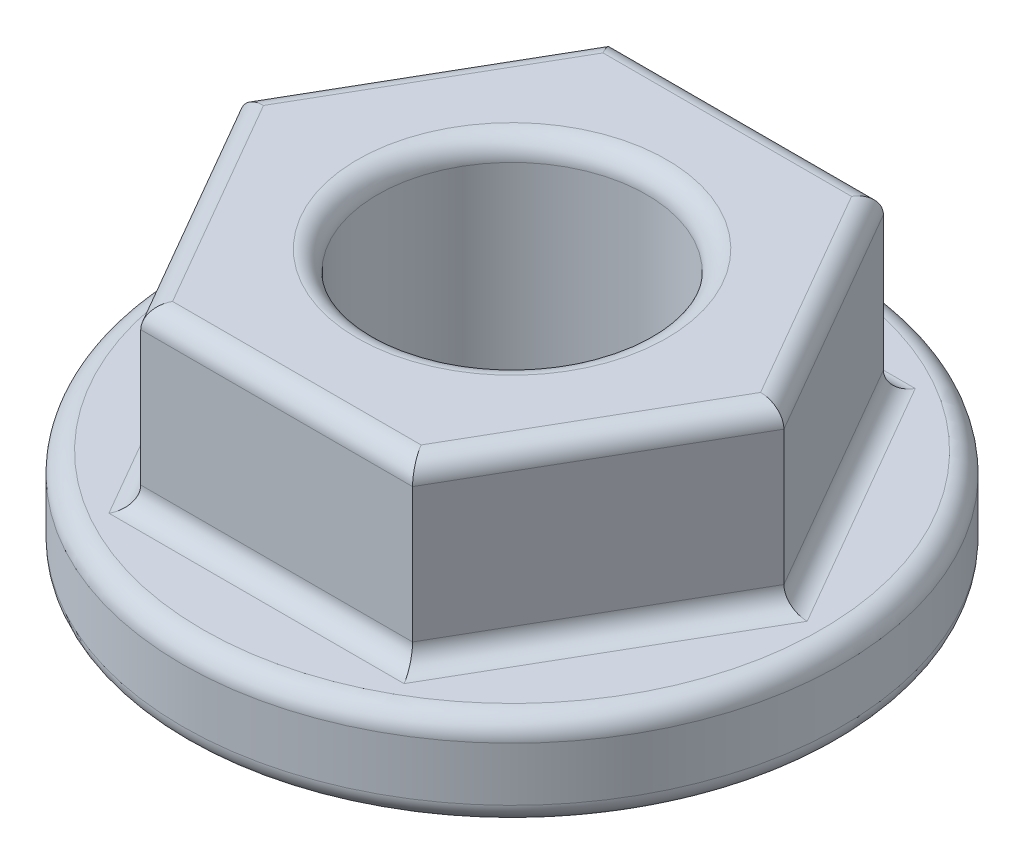
ISO-10303-21;
HEADER;
FILE_DESCRIPTION(('STEP AP214'),'2;1');
FILE_NAME('part.step','',(''),(''),'','','');
FILE_SCHEMA(('AUTOMOTIVE_DESIGN { 1 0 10303 214 1 1 1 1 }'));
ENDSEC;
DATA;
#1=APPLICATION_CONTEXT('core data for automotive mechanical design processes');
#2=APPLICATION_PROTOCOL_DEFINITION('international standard','automotive_design',2000,#1);
#3=PRODUCT_CONTEXT('',#1,'mechanical');
#4=PRODUCT('Part','Part','',(#3));
#5=PRODUCT_RELATED_PRODUCT_CATEGORY('part','',(#4));
#6=PRODUCT_DEFINITION_FORMATION('','',#4);
#7=PRODUCT_DEFINITION_CONTEXT('part definition',#1,'design');
#8=PRODUCT_DEFINITION('design','',#6,#7);
#9=PRODUCT_DEFINITION_SHAPE('','',#8);
#10=(LENGTH_UNIT() NAMED_UNIT(*) SI_UNIT(.MILLI.,.METRE.));
#11=(NAMED_UNIT(*) PLANE_ANGLE_UNIT() SI_UNIT($,.RADIAN.));
#12=(NAMED_UNIT(*) SI_UNIT($,.STERADIAN.) SOLID_ANGLE_UNIT());
#13=UNCERTAINTY_MEASURE_WITH_UNIT(LENGTH_MEASURE(1.E-05),#10,'distance_accuracy_value','');
#14=(GEOMETRIC_REPRESENTATION_CONTEXT(3) GLOBAL_UNCERTAINTY_ASSIGNED_CONTEXT((#13)) GLOBAL_UNIT_ASSIGNED_CONTEXT((#10,
#11,#12)) REPRESENTATION_CONTEXT('',''));
#15=CARTESIAN_POINT('',(0.,0.,0.));
#16=DIRECTION('',(0.,0.,1.));
#17=DIRECTION('',(1.,0.,0.));
#18=AXIS2_PLACEMENT_3D('',#15,#16,#17);
#19=CARTESIAN_POINT('',(0.,4.,0.));
#20=DIRECTION('',(0.,-1.,0.));
#21=DIRECTION('',(0.,0.,-1.));
#22=AXIS2_PLACEMENT_3D('',#19,#20,#21);
#23=CYLINDRICAL_SURFACE('',#22,4.9);
#24=CARTESIAN_POINT('',(0.,0.3,0.));
#25=DIRECTION('',(0.,1.,0.));
#26=DIRECTION('',(0.,0.,1.));
#27=AXIS2_PLACEMENT_3D('',#24,#25,#26);
#28=CIRCLE('',#27,4.9);
#29=CARTESIAN_POINT('',(0.,0.3,4.9));
#30=VERTEX_POINT('',#29);
#31=EDGE_CURVE('E247',#30,#30,#28,.T.);
#32=ORIENTED_EDGE('',*,*,#31,.T.);
#33=EDGE_LOOP('',(#32));
#34=FACE_BOUND('',#33,.T.);
#35=CARTESIAN_POINT('',(0.,1.1,0.));
#36=DIRECTION('',(0.,1.,0.));
#37=DIRECTION('',(0.,0.,1.));
#38=AXIS2_PLACEMENT_3D('',#35,#36,#37);
#39=CIRCLE('',#38,4.9);
#40=CARTESIAN_POINT('',(0.,1.1,4.9));
#41=VERTEX_POINT('',#40);
#42=EDGE_CURVE('E244',#41,#41,#39,.F.);
#43=ORIENTED_EDGE('',*,*,#42,.T.);
#44=EDGE_LOOP('',(#43));
#45=FACE_BOUND('',#44,.T.);
#46=ADVANCED_FACE('F34',(#34,#45),#23,.T.);
#47=CARTESIAN_POINT('',(0.,4.,0.));
#48=DIRECTION('',(0.,1.,0.));
#49=DIRECTION('',(0.,0.,1.));
#50=AXIS2_PLACEMENT_3D('',#47,#48,#49);
#51=PLANE('',#50);
#52=DIRECTION('',(-0.5,0.,0.866025403784439));
#53=VECTOR('',#52,1.);
#54=CARTESIAN_POINT('',(-2.77128129211021,4.,-1.6));
#55=LINE('',#54,#53);
#56=CARTESIAN_POINT('',(-1.8475208614068,4.,-3.2));
#57=VERTEX_POINT('',#56);
#58=CARTESIAN_POINT('',(-3.69504172281361,4.,0.));
#59=VERTEX_POINT('',#58);
#60=EDGE_CURVE('E43',#57,#59,#55,.T.);
#61=ORIENTED_EDGE('',*,*,#60,.T.);
#62=DIRECTION('',(0.5,0.,0.866025403784438));
#63=VECTOR('',#62,1.);
#64=CARTESIAN_POINT('',(-2.7712812921102,4.,1.6));
#65=LINE('',#64,#63);
#66=CARTESIAN_POINT('',(-1.8475208614068,4.,3.2));
#67=VERTEX_POINT('',#66);
#68=EDGE_CURVE('E12',#59,#67,#65,.T.);
#69=ORIENTED_EDGE('',*,*,#68,.T.);
#70=DIRECTION('',(1.,0.,0.));
#71=VECTOR('',#70,1.);
#72=CARTESIAN_POINT('',(0.,4.,3.2));
#73=LINE('',#72,#71);
#74=CARTESIAN_POINT('',(1.84752086140681,4.,3.2));
#75=VERTEX_POINT('',#74);
#76=EDGE_CURVE('E185',#67,#75,#73,.T.);
#77=ORIENTED_EDGE('',*,*,#76,.T.);
#78=DIRECTION('',(0.5,0.,-0.866025403784439));
#79=VECTOR('',#78,1.);
#80=CARTESIAN_POINT('',(2.77128129211021,4.,1.6));
#81=LINE('',#80,#79);
#82=CARTESIAN_POINT('',(3.69504172281361,4.,0.));
#83=VERTEX_POINT('',#82);
#84=EDGE_CURVE('E187',#75,#83,#81,.T.);
#85=ORIENTED_EDGE('',*,*,#84,.T.);
#86=DIRECTION('',(-0.5,0.,-0.866025403784439));
#87=VECTOR('',#86,1.);
#88=CARTESIAN_POINT('',(2.7712812921102,4.,-1.6));
#89=LINE('',#88,#87);
#90=CARTESIAN_POINT('',(1.8475208614068,4.,-3.2));
#91=VERTEX_POINT('',#90);
#92=EDGE_CURVE('E189',#83,#91,#89,.T.);
#93=ORIENTED_EDGE('',*,*,#92,.T.);
#94=DIRECTION('',(-1.,0.,0.));
#95=VECTOR('',#94,1.);
#96=CARTESIAN_POINT('',(0.,4.,-3.2));
#97=LINE('',#96,#95);
#98=EDGE_CURVE('E54',#91,#57,#97,.T.);
#99=ORIENTED_EDGE('',*,*,#98,.T.);
#100=EDGE_LOOP('',(#61,#69,#77,#85,#93,#99));
#101=FACE_BOUND('',#100,.T.);
#102=CARTESIAN_POINT('',(0.,4.,0.));
#103=DIRECTION('',(0.,1.,0.));
#104=DIRECTION('',(0.,0.,1.));
#105=AXIS2_PLACEMENT_3D('',#102,#103,#104);
#106=CIRCLE('',#105,2.3);
#107=CARTESIAN_POINT('',(0.,4.,2.3));
#108=VERTEX_POINT('',#107);
#109=EDGE_CURVE('E182',#108,#108,#106,.F.);
#110=ORIENTED_EDGE('',*,*,#109,.T.);
#111=EDGE_LOOP('',(#110));
#112=FACE_BOUND('',#111,.T.);
#113=ADVANCED_FACE('F322',(#101,#112),#51,.T.);
#114=CARTESIAN_POINT('',(0.,0.,0.));
#115=DIRECTION('',(0.,1.,0.));
#116=DIRECTION('',(0.,0.,1.));
#117=AXIS2_PLACEMENT_3D('',#114,#115,#116);
#118=PLANE('',#117);
#119=CARTESIAN_POINT('',(0.,0.,0.));
#120=DIRECTION('',(0.,1.,0.));
#121=DIRECTION('',(0.,0.,1.));
#122=AXIS2_PLACEMENT_3D('',#119,#120,#121);
#123=CIRCLE('',#122,4.6);
#124=CARTESIAN_POINT('',(0.,0.,4.6));
#125=VERTEX_POINT('',#124);
#126=EDGE_CURVE('E254',#125,#125,#123,.F.);
#127=ORIENTED_EDGE('',*,*,#126,.T.);
#128=EDGE_LOOP('',(#127));
#129=FACE_BOUND('',#128,.T.);
#130=CARTESIAN_POINT('',(0.,0.,0.));
#131=DIRECTION('',(0.,1.,0.));
#132=DIRECTION('',(0.,0.,1.));
#133=AXIS2_PLACEMENT_3D('',#130,#131,#132);
#134=CIRCLE('',#133,2.3);
#135=CARTESIAN_POINT('',(0.,0.,2.3));
#136=VERTEX_POINT('',#135);
#137=EDGE_CURVE('E251',#136,#136,#134,.T.);
#138=ORIENTED_EDGE('',*,*,#137,.T.);
#139=EDGE_LOOP('',(#138));
#140=FACE_BOUND('',#139,.T.);
#141=ADVANCED_FACE('F328',(#129,#140),#118,.F.);
#142=CARTESIAN_POINT('',(0.,-0.799999999999999,0.));
#143=DIRECTION('',(0.,1.,0.));
#144=DIRECTION('',(0.,0.,1.));
#145=AXIS2_PLACEMENT_3D('',#142,#143,#144);
#146=CYLINDRICAL_SURFACE('',#145,2.);
#147=CARTESIAN_POINT('',(0.,0.3,0.));
#148=DIRECTION('',(0.,1.,0.));
#149=DIRECTION('',(0.,0.,1.));
#150=AXIS2_PLACEMENT_3D('',#147,#148,#149);
#151=CIRCLE('',#150,2.);
#152=CARTESIAN_POINT('',(0.,0.3,2.));
#153=VERTEX_POINT('',#152);
#154=EDGE_CURVE('E145',#153,#153,#151,.F.);
#155=ORIENTED_EDGE('',*,*,#154,.T.);
#156=EDGE_LOOP('',(#155));
#157=FACE_BOUND('',#156,.T.);
#158=CARTESIAN_POINT('',(0.,3.7,0.));
#159=DIRECTION('',(0.,1.,0.));
#160=DIRECTION('',(0.,0.,1.));
#161=AXIS2_PLACEMENT_3D('',#158,#159,#160);
#162=CIRCLE('',#161,2.);
#163=CARTESIAN_POINT('',(0.,3.7,2.));
#164=VERTEX_POINT('',#163);
#165=EDGE_CURVE('E257',#164,#164,#162,.T.);
#166=ORIENTED_EDGE('',*,*,#165,.T.);
#167=EDGE_LOOP('',(#166));
#168=FACE_BOUND('',#167,.T.);
#169=ADVANCED_FACE('F502',(#157,#168),#146,.F.);
#170=CARTESIAN_POINT('',(0.,1.4,0.));
#171=DIRECTION('',(0.,1.,0.));
#172=DIRECTION('',(0.,0.,1.));
#173=AXIS2_PLACEMENT_3D('',#170,#171,#172);
#174=PLANE('',#173);
#175=CARTESIAN_POINT('',(0.,1.4,0.));
#176=DIRECTION('',(0.,1.,0.));
#177=DIRECTION('',(0.,0.,1.));
#178=AXIS2_PLACEMENT_3D('',#175,#176,#177);
#179=CIRCLE('',#178,4.6);
#180=CARTESIAN_POINT('',(0.,1.4,4.6));
#181=VERTEX_POINT('',#180);
#182=EDGE_CURVE('E150',#181,#181,#179,.T.);
#183=ORIENTED_EDGE('',*,*,#182,.T.);
#184=EDGE_LOOP('',(#183));
#185=FACE_BOUND('',#184,.T.);
#186=DIRECTION('',(-0.5,0.,-0.866025403784439));
#187=VECTOR('',#186,1.);
#188=CARTESIAN_POINT('',(4.30125950546271,1.4,-0.149999999999998));
#189=LINE('',#188,#187);
#190=CARTESIAN_POINT('',(2.19393102292058,1.4,-3.8));
#191=VERTEX_POINT('',#190);
#192=CARTESIAN_POINT('',(4.38786204584116,1.4,0.));
#193=VERTEX_POINT('',#192);
#194=EDGE_CURVE('E149',#191,#193,#189,.F.);
#195=ORIENTED_EDGE('',*,*,#194,.T.);
#196=DIRECTION('',(0.5,0.,-0.866025403784439));
#197=VECTOR('',#196,1.);
#198=CARTESIAN_POINT('',(2.28053356329902,1.4,3.65));
#199=LINE('',#198,#197);
#200=CARTESIAN_POINT('',(2.19393102292058,1.4,3.8));
#201=VERTEX_POINT('',#200);
#202=EDGE_CURVE('E128',#193,#201,#199,.F.);
#203=ORIENTED_EDGE('',*,*,#202,.T.);
#204=DIRECTION('',(1.,0.,0.));
#205=VECTOR('',#204,1.);
#206=CARTESIAN_POINT('',(-2.02072594216369,1.4,3.8));
#207=LINE('',#206,#205);
#208=CARTESIAN_POINT('',(-2.19393102292058,1.4,3.8));
#209=VERTEX_POINT('',#208);
#210=EDGE_CURVE('E138',#201,#209,#207,.F.);
#211=ORIENTED_EDGE('',*,*,#210,.T.);
#212=DIRECTION('',(0.5,0.,0.866025403784438));
#213=VECTOR('',#212,1.);
#214=CARTESIAN_POINT('',(-4.30125950546271,1.4,0.15));
#215=LINE('',#214,#213);
#216=CARTESIAN_POINT('',(-4.38786204584116,1.4,0.));
#217=VERTEX_POINT('',#216);
#218=EDGE_CURVE('E144',#209,#217,#215,.F.);
#219=ORIENTED_EDGE('',*,*,#218,.T.);
#220=DIRECTION('',(-0.5,0.,0.866025403784439));
#221=VECTOR('',#220,1.);
#222=CARTESIAN_POINT('',(-2.28053356329902,1.4,-3.65));
#223=LINE('',#222,#221);
#224=CARTESIAN_POINT('',(-2.19393102292058,1.4,-3.8));
#225=VERTEX_POINT('',#224);
#226=EDGE_CURVE('E263',#217,#225,#223,.F.);
#227=ORIENTED_EDGE('',*,*,#226,.T.);
#228=DIRECTION('',(-1.,0.,0.));
#229=VECTOR('',#228,1.);
#230=CARTESIAN_POINT('',(2.02072594216369,1.4,-3.8));
#231=LINE('',#230,#229);
#232=EDGE_CURVE('E155',#225,#191,#231,.F.);
#233=ORIENTED_EDGE('',*,*,#232,.T.);
#234=EDGE_LOOP('',(#195,#203,#211,#219,#227,#233));
#235=FACE_BOUND('',#234,.T.);
#236=ADVANCED_FACE('F147',(#185,#235),#174,.T.);
#237=CARTESIAN_POINT('',(2.02072594216369,1.4,3.5));
#238=DIRECTION('',(0.866025403784439,0.,0.5));
#239=DIRECTION('',(0.5,0.,-0.866025403784439));
#240=AXIS2_PLACEMENT_3D('',#237,#238,#239);
#241=PLANE('',#240);
#242=DIRECTION('',(0.,1.,0.));
#243=VECTOR('',#242,1.);
#244=CARTESIAN_POINT('',(2.02072594216369,1.4,3.5));
#245=LINE('',#244,#243);
#246=CARTESIAN_POINT('',(2.02072594216369,1.7,3.5));
#247=VERTEX_POINT('',#246);
#248=CARTESIAN_POINT('',(2.02072594216369,3.7,3.5));
#249=VERTEX_POINT('',#248);
#250=EDGE_CURVE('E248',#247,#249,#245,.T.);
#251=ORIENTED_EDGE('',*,*,#250,.F.);
#252=DIRECTION('',(0.5,0.,-0.866025403784439));
#253=VECTOR('',#252,1.);
#254=CARTESIAN_POINT('',(4.04145188432738,1.7,0.));
#255=LINE('',#254,#253);
#256=CARTESIAN_POINT('',(4.04145188432738,1.7,0.));
#257=VERTEX_POINT('',#256);
#258=EDGE_CURVE('E131',#247,#257,#255,.T.);
#259=ORIENTED_EDGE('',*,*,#258,.T.);
#260=DIRECTION('',(0.,1.,0.));
#261=VECTOR('',#260,1.);
#262=CARTESIAN_POINT('',(4.04145188432738,1.4,0.));
#263=LINE('',#262,#261);
#264=CARTESIAN_POINT('',(4.04145188432738,3.7,0.));
#265=VERTEX_POINT('',#264);
#266=EDGE_CURVE('E203',#257,#265,#263,.T.);
#267=ORIENTED_EDGE('',*,*,#266,.T.);
#268=DIRECTION('',(0.5,0.,-0.866025403784439));
#269=VECTOR('',#268,1.);
#270=CARTESIAN_POINT('',(2.02072594216369,3.7,3.5));
#271=LINE('',#270,#269);
#272=EDGE_CURVE('E153',#265,#249,#271,.F.);
#273=ORIENTED_EDGE('',*,*,#272,.T.);
#274=EDGE_LOOP('',(#251,#259,#267,#273));
#275=FACE_BOUND('',#274,.T.);
#276=ADVANCED_FACE('F237',(#275),#241,.T.);
#277=CARTESIAN_POINT('',(-2.02072594216369,1.4,3.5));
#278=DIRECTION('',(0.,0.,1.));
#279=DIRECTION('',(1.,0.,0.));
#280=AXIS2_PLACEMENT_3D('',#277,#278,#279);
#281=PLANE('',#280);
#282=DIRECTION('',(0.,1.,0.));
#283=VECTOR('',#282,1.);
#284=CARTESIAN_POINT('',(-2.02072594216369,1.4,3.5));
#285=LINE('',#284,#283);
#286=CARTESIAN_POINT('',(-2.02072594216369,1.7,3.5));
#287=VERTEX_POINT('',#286);
#288=CARTESIAN_POINT('',(-2.02072594216369,3.7,3.5));
#289=VERTEX_POINT('',#288);
#290=EDGE_CURVE('E282',#287,#289,#285,.T.);
#291=ORIENTED_EDGE('',*,*,#290,.F.);
#292=DIRECTION('',(1.,0.,0.));
#293=VECTOR('',#292,1.);
#294=CARTESIAN_POINT('',(2.02072594216369,1.7,3.5));
#295=LINE('',#294,#293);
#296=EDGE_CURVE('E180',#287,#247,#295,.T.);
#297=ORIENTED_EDGE('',*,*,#296,.T.);
#298=ORIENTED_EDGE('',*,*,#250,.T.);
#299=DIRECTION('',(1.,0.,0.));
#300=VECTOR('',#299,1.);
#301=CARTESIAN_POINT('',(-2.02072594216369,3.7,3.5));
#302=LINE('',#301,#300);
#303=EDGE_CURVE('E178',#249,#289,#302,.F.);
#304=ORIENTED_EDGE('',*,*,#303,.T.);
#305=EDGE_LOOP('',(#291,#297,#298,#304));
#306=FACE_BOUND('',#305,.T.);
#307=ADVANCED_FACE('F290',(#306),#281,.T.);
#308=CARTESIAN_POINT('',(-4.04145188432738,1.4,0.));
#309=DIRECTION('',(-0.866025403784438,0.,0.5));
#310=DIRECTION('',(0.5,0.,0.866025403784438));
#311=AXIS2_PLACEMENT_3D('',#308,#309,#310);
#312=PLANE('',#311);
#313=DIRECTION('',(0.,1.,0.));
#314=VECTOR('',#313,1.);
#315=CARTESIAN_POINT('',(-4.04145188432738,1.4,0.));
#316=LINE('',#315,#314);
#317=CARTESIAN_POINT('',(-4.04145188432738,1.7,0.));
#318=VERTEX_POINT('',#317);
#319=CARTESIAN_POINT('',(-4.04145188432738,3.7,0.));
#320=VERTEX_POINT('',#319);
#321=EDGE_CURVE('E280',#318,#320,#316,.T.);
#322=ORIENTED_EDGE('',*,*,#321,.F.);
#323=DIRECTION('',(0.5,0.,0.866025403784438));
#324=VECTOR('',#323,1.);
#325=CARTESIAN_POINT('',(-2.02072594216369,1.7,3.5));
#326=LINE('',#325,#324);
#327=EDGE_CURVE('E176',#318,#287,#326,.T.);
#328=ORIENTED_EDGE('',*,*,#327,.T.);
#329=ORIENTED_EDGE('',*,*,#290,.T.);
#330=DIRECTION('',(0.5,0.,0.866025403784438));
#331=VECTOR('',#330,1.);
#332=CARTESIAN_POINT('',(-4.04145188432738,3.7,0.));
#333=LINE('',#332,#331);
#334=EDGE_CURVE('E173',#289,#320,#333,.F.);
#335=ORIENTED_EDGE('',*,*,#334,.T.);
#336=EDGE_LOOP('',(#322,#328,#329,#335));
#337=FACE_BOUND('',#336,.T.);
#338=ADVANCED_FACE('F304',(#337),#312,.T.);
#339=CARTESIAN_POINT('',(-2.02072594216369,1.4,-3.5));
#340=DIRECTION('',(-0.866025403784439,0.,-0.5));
#341=DIRECTION('',(-0.5,0.,0.866025403784439));
#342=AXIS2_PLACEMENT_3D('',#339,#340,#341);
#343=PLANE('',#342);
#344=DIRECTION('',(0.,1.,0.));
#345=VECTOR('',#344,1.);
#346=CARTESIAN_POINT('',(-2.02072594216369,1.4,-3.5));
#347=LINE('',#346,#345);
#348=CARTESIAN_POINT('',(-2.02072594216369,1.7,-3.5));
#349=VERTEX_POINT('',#348);
#350=CARTESIAN_POINT('',(-2.02072594216369,3.7,-3.5));
#351=VERTEX_POINT('',#350);
#352=EDGE_CURVE('E240',#349,#351,#347,.T.);
#353=ORIENTED_EDGE('',*,*,#352,.F.);
#354=DIRECTION('',(-0.5,0.,0.866025403784439));
#355=VECTOR('',#354,1.);
#356=CARTESIAN_POINT('',(-4.04145188432738,1.7,0.));
#357=LINE('',#356,#355);
#358=EDGE_CURVE('E171',#349,#318,#357,.T.);
#359=ORIENTED_EDGE('',*,*,#358,.T.);
#360=ORIENTED_EDGE('',*,*,#321,.T.);
#361=DIRECTION('',(-0.5,0.,0.866025403784439));
#362=VECTOR('',#361,1.);
#363=CARTESIAN_POINT('',(-2.02072594216369,3.7,-3.5));
#364=LINE('',#363,#362);
#365=EDGE_CURVE('E169',#320,#351,#364,.F.);
#366=ORIENTED_EDGE('',*,*,#365,.T.);
#367=EDGE_LOOP('',(#353,#359,#360,#366));
#368=FACE_BOUND('',#367,.T.);
#369=ADVANCED_FACE('F306',(#368),#343,.T.);
#370=CARTESIAN_POINT('',(2.02072594216369,1.4,-3.5));
#371=DIRECTION('',(0.,0.,-1.));
#372=DIRECTION('',(-1.,0.,0.));
#373=AXIS2_PLACEMENT_3D('',#370,#371,#372);
#374=PLANE('',#373);
#375=DIRECTION('',(0.,1.,0.));
#376=VECTOR('',#375,1.);
#377=CARTESIAN_POINT('',(2.02072594216369,1.4,-3.5));
#378=LINE('',#377,#376);
#379=CARTESIAN_POINT('',(2.02072594216369,1.7,-3.5));
#380=VERTEX_POINT('',#379);
#381=CARTESIAN_POINT('',(2.02072594216369,3.7,-3.5));
#382=VERTEX_POINT('',#381);
#383=EDGE_CURVE('E234',#380,#382,#378,.T.);
#384=ORIENTED_EDGE('',*,*,#383,.F.);
#385=DIRECTION('',(-1.,0.,0.));
#386=VECTOR('',#385,1.);
#387=CARTESIAN_POINT('',(-2.02072594216369,1.7,-3.5));
#388=LINE('',#387,#386);
#389=EDGE_CURVE('E167',#380,#349,#388,.T.);
#390=ORIENTED_EDGE('',*,*,#389,.T.);
#391=ORIENTED_EDGE('',*,*,#352,.T.);
#392=DIRECTION('',(-1.,0.,0.));
#393=VECTOR('',#392,1.);
#394=CARTESIAN_POINT('',(2.02072594216369,3.7,-3.5));
#395=LINE('',#394,#393);
#396=EDGE_CURVE('E165',#351,#382,#395,.F.);
#397=ORIENTED_EDGE('',*,*,#396,.T.);
#398=EDGE_LOOP('',(#384,#390,#391,#397));
#399=FACE_BOUND('',#398,.T.);
#400=ADVANCED_FACE('F275',(#399),#374,.T.);
#401=CARTESIAN_POINT('',(4.04145188432738,1.4,0.));
#402=DIRECTION('',(0.866025403784438,0.,-0.5));
#403=DIRECTION('',(-0.5,0.,-0.866025403784439));
#404=AXIS2_PLACEMENT_3D('',#401,#402,#403);
#405=PLANE('',#404);
#406=ORIENTED_EDGE('',*,*,#266,.F.);
#407=DIRECTION('',(-0.5,0.,-0.866025403784439));
#408=VECTOR('',#407,1.);
#409=CARTESIAN_POINT('',(2.02072594216369,1.7,-3.5));
#410=LINE('',#409,#408);
#411=EDGE_CURVE('E163',#257,#380,#410,.T.);
#412=ORIENTED_EDGE('',*,*,#411,.T.);
#413=ORIENTED_EDGE('',*,*,#383,.T.);
#414=DIRECTION('',(-0.5,0.,-0.866025403784439));
#415=VECTOR('',#414,1.);
#416=CARTESIAN_POINT('',(4.04145188432738,3.7,0.));
#417=LINE('',#416,#415);
#418=EDGE_CURVE('E161',#382,#265,#417,.F.);
#419=ORIENTED_EDGE('',*,*,#418,.T.);
#420=EDGE_LOOP('',(#406,#412,#413,#419));
#421=FACE_BOUND('',#420,.T.);
#422=ADVANCED_FACE('F232',(#421),#405,.T.);
#423=CARTESIAN_POINT('',(0.,0.3,0.));
#424=DIRECTION('',(0.,1.,0.));
#425=DIRECTION('',(0.,0.,1.));
#426=AXIS2_PLACEMENT_3D('',#423,#424,#425);
#427=TOROIDAL_SURFACE('',#426,4.6,0.3);
#428=ORIENTED_EDGE('',*,*,#126,.F.);
#429=EDGE_LOOP('',(#428));
#430=FACE_BOUND('',#429,.T.);
#431=ORIENTED_EDGE('',*,*,#31,.F.);
#432=EDGE_LOOP('',(#431));
#433=FACE_BOUND('',#432,.T.);
#434=ADVANCED_FACE('F333',(#430,#433),#427,.T.);
#435=CARTESIAN_POINT('',(0.,0.3,0.));
#436=DIRECTION('',(0.,1.,0.));
#437=DIRECTION('',(0.,0.,1.));
#438=AXIS2_PLACEMENT_3D('',#435,#436,#437);
#439=TOROIDAL_SURFACE('',#438,2.3,0.3);
#440=ORIENTED_EDGE('',*,*,#154,.F.);
#441=EDGE_LOOP('',(#440));
#442=FACE_BOUND('',#441,.T.);
#443=ORIENTED_EDGE('',*,*,#137,.F.);
#444=EDGE_LOOP('',(#443));
#445=FACE_BOUND('',#444,.T.);
#446=ADVANCED_FACE('F336',(#442,#445),#439,.T.);
#447=CARTESIAN_POINT('',(0.,1.1,0.));
#448=DIRECTION('',(0.,1.,0.));
#449=DIRECTION('',(0.,0.,1.));
#450=AXIS2_PLACEMENT_3D('',#447,#448,#449);
#451=TOROIDAL_SURFACE('',#450,4.6,0.3);
#452=ORIENTED_EDGE('',*,*,#42,.F.);
#453=EDGE_LOOP('',(#452));
#454=FACE_BOUND('',#453,.T.);
#455=ORIENTED_EDGE('',*,*,#182,.F.);
#456=EDGE_LOOP('',(#455));
#457=FACE_BOUND('',#456,.T.);
#458=ADVANCED_FACE('F319',(#454,#457),#451,.T.);
#459=CARTESIAN_POINT('',(-2.28053356329902,1.7,-3.65));
#460=DIRECTION('',(0.5,0.,-0.866025403784439));
#461=DIRECTION('',(-0.866025403784439,0.,-0.5));
#462=AXIS2_PLACEMENT_3D('',#459,#460,#461);
#463=CYLINDRICAL_SURFACE('',#462,0.3);
#464=CARTESIAN_POINT('',(-2.19393102292058,1.7,-3.8));
#465=DIRECTION('',(0.866025403784439,0.,-0.5));
#466=DIRECTION('',(-0.5,0.,-0.866025403784439));
#467=AXIS2_PLACEMENT_3D('',#464,#465,#466);
#468=ELLIPSE('',#467,0.346410161513775,0.3);
#469=EDGE_CURVE('E197',#225,#349,#468,.F.);
#470=ORIENTED_EDGE('',*,*,#469,.F.);
#471=ORIENTED_EDGE('',*,*,#226,.F.);
#472=CARTESIAN_POINT('',(-4.38786204584116,1.7,0.));
#473=DIRECTION('',(0.,0.,-1.));
#474=DIRECTION('',(-1.,0.,0.));
#475=AXIS2_PLACEMENT_3D('',#472,#473,#474);
#476=ELLIPSE('',#475,0.346410161513775,0.3);
#477=EDGE_CURVE('E200',#318,#217,#476,.T.);
#478=ORIENTED_EDGE('',*,*,#477,.F.);
#479=ORIENTED_EDGE('',*,*,#358,.F.);
#480=EDGE_LOOP('',(#470,#471,#478,#479));
#481=FACE_BOUND('',#480,.T.);
#482=ADVANCED_FACE('F308',(#481),#463,.F.);
#483=CARTESIAN_POINT('',(-4.30125950546271,1.7,0.15));
#484=DIRECTION('',(-0.5,0.,-0.866025403784438));
#485=DIRECTION('',(-0.866025403784438,0.,0.5));
#486=AXIS2_PLACEMENT_3D('',#483,#484,#485);
#487=CYLINDRICAL_SURFACE('',#486,0.3);
#488=ORIENTED_EDGE('',*,*,#477,.T.);
#489=ORIENTED_EDGE('',*,*,#218,.F.);
#490=CARTESIAN_POINT('',(-2.19393102292058,1.7,3.8));
#491=DIRECTION('',(-0.866025403784439,0.,-0.5));
#492=DIRECTION('',(-0.5,0.,0.866025403784439));
#493=AXIS2_PLACEMENT_3D('',#490,#491,#492);
#494=ELLIPSE('',#493,0.346410161513775,0.3);
#495=EDGE_CURVE('E141',#287,#209,#494,.T.);
#496=ORIENTED_EDGE('',*,*,#495,.F.);
#497=ORIENTED_EDGE('',*,*,#327,.F.);
#498=EDGE_LOOP('',(#488,#489,#496,#497));
#499=FACE_BOUND('',#498,.T.);
#500=ADVANCED_FACE('F311',(#499),#487,.F.);
#501=CARTESIAN_POINT('',(2.02072594216369,1.7,-3.8));
#502=DIRECTION('',(1.,0.,0.));
#503=DIRECTION('',(0.,0.,-1.));
#504=AXIS2_PLACEMENT_3D('',#501,#502,#503);
#505=CYLINDRICAL_SURFACE('',#504,0.3);
#506=ORIENTED_EDGE('',*,*,#469,.T.);
#507=ORIENTED_EDGE('',*,*,#389,.F.);
#508=CARTESIAN_POINT('',(2.19393102292058,1.7,-3.8));
#509=DIRECTION('',(0.866025403784439,0.,0.5));
#510=DIRECTION('',(0.5,0.,-0.866025403784439));
#511=AXIS2_PLACEMENT_3D('',#508,#509,#510);
#512=ELLIPSE('',#511,0.346410161513775,0.3);
#513=EDGE_CURVE('E134',#191,#380,#512,.F.);
#514=ORIENTED_EDGE('',*,*,#513,.F.);
#515=ORIENTED_EDGE('',*,*,#232,.F.);
#516=EDGE_LOOP('',(#506,#507,#514,#515));
#517=FACE_BOUND('',#516,.T.);
#518=ADVANCED_FACE('F270',(#517),#505,.F.);
#519=CARTESIAN_POINT('',(-2.02072594216369,1.7,3.8));
#520=DIRECTION('',(-1.,0.,0.));
#521=DIRECTION('',(0.,0.,1.));
#522=AXIS2_PLACEMENT_3D('',#519,#520,#521);
#523=CYLINDRICAL_SURFACE('',#522,0.3);
#524=ORIENTED_EDGE('',*,*,#495,.T.);
#525=ORIENTED_EDGE('',*,*,#210,.F.);
#526=CARTESIAN_POINT('',(2.19393102292058,1.7,3.8));
#527=DIRECTION('',(-0.866025403784439,0.,0.5));
#528=DIRECTION('',(-0.5,0.,-0.866025403784439));
#529=AXIS2_PLACEMENT_3D('',#526,#527,#528);
#530=ELLIPSE('',#529,0.346410161513775,0.3);
#531=EDGE_CURVE('E124',#247,#201,#530,.T.);
#532=ORIENTED_EDGE('',*,*,#531,.F.);
#533=ORIENTED_EDGE('',*,*,#296,.F.);
#534=EDGE_LOOP('',(#524,#525,#532,#533));
#535=FACE_BOUND('',#534,.T.);
#536=ADVANCED_FACE('F139',(#535),#523,.F.);
#537=CARTESIAN_POINT('',(4.30125950546271,1.7,-0.149999999999998));
#538=DIRECTION('',(0.5,0.,0.866025403784439));
#539=DIRECTION('',(0.866025403784438,0.,-0.5));
#540=AXIS2_PLACEMENT_3D('',#537,#538,#539);
#541=CYLINDRICAL_SURFACE('',#540,0.3);
#542=ORIENTED_EDGE('',*,*,#513,.T.);
#543=ORIENTED_EDGE('',*,*,#411,.F.);
#544=CARTESIAN_POINT('',(4.38786204584116,1.7,0.));
#545=DIRECTION('',(0.,0.,1.));
#546=DIRECTION('',(1.,0.,0.));
#547=AXIS2_PLACEMENT_3D('',#544,#545,#546);
#548=ELLIPSE('',#547,0.346410161513775,0.3);
#549=EDGE_CURVE('E135',#193,#257,#548,.F.);
#550=ORIENTED_EDGE('',*,*,#549,.F.);
#551=ORIENTED_EDGE('',*,*,#194,.F.);
#552=EDGE_LOOP('',(#542,#543,#550,#551));
#553=FACE_BOUND('',#552,.T.);
#554=ADVANCED_FACE('F273',(#553),#541,.F.);
#555=CARTESIAN_POINT('',(2.28053356329902,1.7,3.65));
#556=DIRECTION('',(-0.5,0.,0.866025403784439));
#557=DIRECTION('',(0.866025403784439,0.,0.5));
#558=AXIS2_PLACEMENT_3D('',#555,#556,#557);
#559=CYLINDRICAL_SURFACE('',#558,0.3);
#560=ORIENTED_EDGE('',*,*,#531,.T.);
#561=ORIENTED_EDGE('',*,*,#202,.F.);
#562=ORIENTED_EDGE('',*,*,#549,.T.);
#563=ORIENTED_EDGE('',*,*,#258,.F.);
#564=EDGE_LOOP('',(#560,#561,#562,#563));
#565=FACE_BOUND('',#564,.T.);
#566=ADVANCED_FACE('F126',(#565),#559,.F.);
#567=CARTESIAN_POINT('',(2.7712812921102,3.7,-1.6));
#568=DIRECTION('',(-0.5,0.,-0.866025403784439));
#569=DIRECTION('',(-0.866025403784438,0.,0.5));
#570=AXIS2_PLACEMENT_3D('',#567,#568,#569);
#571=CYLINDRICAL_SURFACE('',#570,0.3);
#572=CARTESIAN_POINT('',(3.69504172281361,3.7,0.));
#573=DIRECTION('',(0.,0.,-1.));
#574=DIRECTION('',(1.,0.,0.));
#575=AXIS2_PLACEMENT_3D('',#572,#573,#574);
#576=ELLIPSE('',#575,0.346410161513775,0.3);
#577=EDGE_CURVE('E213',#265,#83,#576,.F.);
#578=ORIENTED_EDGE('',*,*,#577,.F.);
#579=ORIENTED_EDGE('',*,*,#418,.F.);
#580=CARTESIAN_POINT('',(1.8475208614068,3.7,-3.2));
#581=DIRECTION('',(-0.866025403784439,0.,-0.5));
#582=DIRECTION('',(0.5,0.,-0.866025403784439));
#583=AXIS2_PLACEMENT_3D('',#580,#581,#582);
#584=ELLIPSE('',#583,0.346410161513775,0.3);
#585=EDGE_CURVE('E38',#91,#382,#584,.T.);
#586=ORIENTED_EDGE('',*,*,#585,.F.);
#587=ORIENTED_EDGE('',*,*,#92,.F.);
#588=EDGE_LOOP('',(#578,#579,#586,#587));
#589=FACE_BOUND('',#588,.T.);
#590=ADVANCED_FACE('F227',(#589),#571,.T.);
#591=CARTESIAN_POINT('',(0.,3.7,-3.2));
#592=DIRECTION('',(-1.,0.,0.));
#593=DIRECTION('',(0.,0.,1.));
#594=AXIS2_PLACEMENT_3D('',#591,#592,#593);
#595=CYLINDRICAL_SURFACE('',#594,0.3);
#596=ORIENTED_EDGE('',*,*,#585,.T.);
#597=ORIENTED_EDGE('',*,*,#396,.F.);
#598=CARTESIAN_POINT('',(-1.8475208614068,3.7,-3.2));
#599=DIRECTION('',(-0.866025403784439,0.,0.5));
#600=DIRECTION('',(-0.5,0.,-0.866025403784439));
#601=AXIS2_PLACEMENT_3D('',#598,#599,#600);
#602=ELLIPSE('',#601,0.346410161513775,0.3);
#603=EDGE_CURVE('E211',#57,#351,#602,.T.);
#604=ORIENTED_EDGE('',*,*,#603,.F.);
#605=ORIENTED_EDGE('',*,*,#98,.F.);
#606=EDGE_LOOP('',(#596,#597,#604,#605));
#607=FACE_BOUND('',#606,.T.);
#608=ADVANCED_FACE('F223',(#607),#595,.T.);
#609=CARTESIAN_POINT('',(2.77128129211021,3.7,1.6));
#610=DIRECTION('',(0.5,0.,-0.866025403784439));
#611=DIRECTION('',(-0.866025403784439,0.,-0.5));
#612=AXIS2_PLACEMENT_3D('',#609,#610,#611);
#613=CYLINDRICAL_SURFACE('',#612,0.3);
#614=ORIENTED_EDGE('',*,*,#577,.T.);
#615=ORIENTED_EDGE('',*,*,#84,.F.);
#616=CARTESIAN_POINT('',(1.8475208614068,3.7,3.2));
#617=DIRECTION('',(0.866025403784439,0.,-0.5));
#618=DIRECTION('',(0.5,0.,0.866025403784439));
#619=AXIS2_PLACEMENT_3D('',#616,#617,#618);
#620=ELLIPSE('',#619,0.346410161513775,0.3);
#621=EDGE_CURVE('E208',#249,#75,#620,.F.);
#622=ORIENTED_EDGE('',*,*,#621,.F.);
#623=ORIENTED_EDGE('',*,*,#272,.F.);
#624=EDGE_LOOP('',(#614,#615,#622,#623));
#625=FACE_BOUND('',#624,.T.);
#626=ADVANCED_FACE('F292',(#625),#613,.T.);
#627=CARTESIAN_POINT('',(-2.7712812921102,3.7,-1.6));
#628=DIRECTION('',(-0.5,0.,0.866025403784439));
#629=DIRECTION('',(0.866025403784439,0.,0.5));
#630=AXIS2_PLACEMENT_3D('',#627,#628,#629);
#631=CYLINDRICAL_SURFACE('',#630,0.3);
#632=ORIENTED_EDGE('',*,*,#603,.T.);
#633=ORIENTED_EDGE('',*,*,#365,.F.);
#634=CARTESIAN_POINT('',(-3.69504172281361,3.7,0.));
#635=DIRECTION('',(0.,0.,1.));
#636=DIRECTION('',(-1.,0.,0.));
#637=AXIS2_PLACEMENT_3D('',#634,#635,#636);
#638=ELLIPSE('',#637,0.346410161513775,0.3);
#639=EDGE_CURVE('E206',#59,#320,#638,.T.);
#640=ORIENTED_EDGE('',*,*,#639,.F.);
#641=ORIENTED_EDGE('',*,*,#60,.F.);
#642=EDGE_LOOP('',(#632,#633,#640,#641));
#643=FACE_BOUND('',#642,.T.);
#644=ADVANCED_FACE('F378',(#643),#631,.T.);
#645=CARTESIAN_POINT('',(0.,3.7,3.2));
#646=DIRECTION('',(1.,0.,0.));
#647=DIRECTION('',(0.,0.,-1.));
#648=AXIS2_PLACEMENT_3D('',#645,#646,#647);
#649=CYLINDRICAL_SURFACE('',#648,0.3);
#650=ORIENTED_EDGE('',*,*,#621,.T.);
#651=ORIENTED_EDGE('',*,*,#76,.F.);
#652=CARTESIAN_POINT('',(-1.8475208614068,3.7,3.2));
#653=DIRECTION('',(0.866025403784439,0.,0.5));
#654=DIRECTION('',(0.5,0.,-0.866025403784439));
#655=AXIS2_PLACEMENT_3D('',#652,#653,#654);
#656=ELLIPSE('',#655,0.346410161513775,0.3);
#657=EDGE_CURVE('E204',#289,#67,#656,.F.);
#658=ORIENTED_EDGE('',*,*,#657,.F.);
#659=ORIENTED_EDGE('',*,*,#303,.F.);
#660=EDGE_LOOP('',(#650,#651,#658,#659));
#661=FACE_BOUND('',#660,.T.);
#662=ADVANCED_FACE('F296',(#661),#649,.T.);
#663=CARTESIAN_POINT('',(-2.7712812921102,3.7,1.6));
#664=DIRECTION('',(0.5,0.,0.866025403784438));
#665=DIRECTION('',(0.866025403784438,0.,-0.5));
#666=AXIS2_PLACEMENT_3D('',#663,#664,#665);
#667=CYLINDRICAL_SURFACE('',#666,0.3);
#668=ORIENTED_EDGE('',*,*,#639,.T.);
#669=ORIENTED_EDGE('',*,*,#334,.F.);
#670=ORIENTED_EDGE('',*,*,#657,.T.);
#671=ORIENTED_EDGE('',*,*,#68,.F.);
#672=EDGE_LOOP('',(#668,#669,#670,#671));
#673=FACE_BOUND('',#672,.T.);
#674=ADVANCED_FACE('F300',(#673),#667,.T.);
#675=CARTESIAN_POINT('',(0.,3.7,0.));
#676=DIRECTION('',(0.,1.,0.));
#677=DIRECTION('',(0.,0.,1.));
#678=AXIS2_PLACEMENT_3D('',#675,#676,#677);
#679=TOROIDAL_SURFACE('',#678,2.3,0.3);
#680=ORIENTED_EDGE('',*,*,#109,.F.);
#681=EDGE_LOOP('',(#680));
#682=FACE_BOUND('',#681,.T.);
#683=ORIENTED_EDGE('',*,*,#165,.F.);
#684=EDGE_LOOP('',(#683));
#685=FACE_BOUND('',#684,.T.);
#686=ADVANCED_FACE('F36',(#682,#685),#679,.T.);
#687=CLOSED_SHELL('',(#46,#113,#141,#169,#236,#276,#307,#338,#369,#400,#422,#434,#446,#458,#482,
#500,#518,#536,#554,#566,#590,#608,#626,#644,#662,#674,#686));
#688=MANIFOLD_SOLID_BREP('B2',#687);
#689=ADVANCED_BREP_SHAPE_REPRESENTATION('',(#18,#688),#14);
#690=SHAPE_DEFINITION_REPRESENTATION(#9,#689);
ENDSEC;
END-ISO-10303-21;
